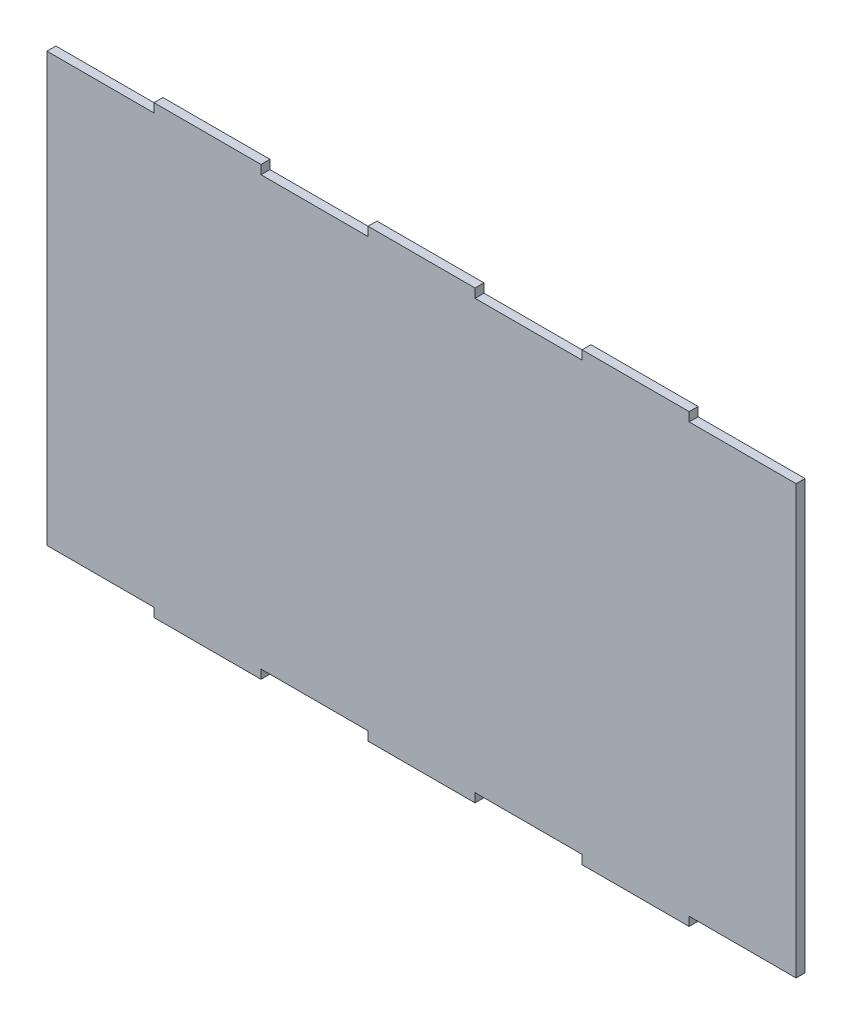
ISO-10303-21;
HEADER;
FILE_DESCRIPTION(('STEP AP214'),'2;1');
FILE_NAME('part.step','',(''),(''),'','','');
FILE_SCHEMA(('AUTOMOTIVE_DESIGN { 1 0 10303 214 1 1 1 1 }'));
ENDSEC;
DATA;
#1=APPLICATION_CONTEXT('core data for automotive mechanical design processes');
#2=APPLICATION_PROTOCOL_DEFINITION('international standard','automotive_design',2000,#1);
#3=PRODUCT_CONTEXT('',#1,'mechanical');
#4=PRODUCT('Part','Part','',(#3));
#5=PRODUCT_RELATED_PRODUCT_CATEGORY('part','',(#4));
#6=PRODUCT_DEFINITION_FORMATION('','',#4);
#7=PRODUCT_DEFINITION_CONTEXT('part definition',#1,'design');
#8=PRODUCT_DEFINITION('design','',#6,#7);
#9=PRODUCT_DEFINITION_SHAPE('','',#8);
#10=(LENGTH_UNIT() NAMED_UNIT(*) SI_UNIT(.MILLI.,.METRE.));
#11=(NAMED_UNIT(*) PLANE_ANGLE_UNIT() SI_UNIT($,.RADIAN.));
#12=(NAMED_UNIT(*) SI_UNIT($,.STERADIAN.) SOLID_ANGLE_UNIT());
#13=UNCERTAINTY_MEASURE_WITH_UNIT(LENGTH_MEASURE(1.E-05),#10,'distance_accuracy_value','');
#14=(GEOMETRIC_REPRESENTATION_CONTEXT(3) GLOBAL_UNCERTAINTY_ASSIGNED_CONTEXT((#13)) GLOBAL_UNIT_ASSIGNED_CONTEXT((#10,
#11,#12)) REPRESENTATION_CONTEXT('',''));
#15=CARTESIAN_POINT('',(0.,0.,0.));
#16=DIRECTION('',(0.,0.,1.));
#17=DIRECTION('',(1.,0.,0.));
#18=AXIS2_PLACEMENT_3D('',#15,#16,#17);
#19=CARTESIAN_POINT('',(360.,0.,5.));
#20=DIRECTION('',(-1.,0.,0.));
#21=DIRECTION('',(0.,0.,1.));
#22=AXIS2_PLACEMENT_3D('',#19,#20,#21);
#23=PLANE('',#22);
#24=DIRECTION('',(0.,1.,0.));
#25=VECTOR('',#24,1.);
#26=CARTESIAN_POINT('',(360.,0.,0.));
#27=LINE('',#26,#25);
#28=CARTESIAN_POINT('',(360.,0.,0.));
#29=VERTEX_POINT('',#28);
#30=CARTESIAN_POINT('',(360.,5.,0.));
#31=VERTEX_POINT('',#30);
#32=EDGE_CURVE('E262',#29,#31,#27,.T.);
#33=ORIENTED_EDGE('',*,*,#32,.T.);
#34=DIRECTION('',(0.,0.,-1.));
#35=VECTOR('',#34,1.);
#36=CARTESIAN_POINT('',(360.,5.,5.));
#37=LINE('',#36,#35);
#38=CARTESIAN_POINT('',(360.,5.,5.));
#39=VERTEX_POINT('',#38);
#40=EDGE_CURVE('E11',#39,#31,#37,.T.);
#41=ORIENTED_EDGE('',*,*,#40,.F.);
#42=DIRECTION('',(0.,1.,0.));
#43=VECTOR('',#42,1.);
#44=CARTESIAN_POINT('',(360.,0.,5.));
#45=LINE('',#44,#43);
#46=CARTESIAN_POINT('',(360.,0.,5.));
#47=VERTEX_POINT('',#46);
#48=EDGE_CURVE('E359',#47,#39,#45,.T.);
#49=ORIENTED_EDGE('',*,*,#48,.F.);
#50=DIRECTION('',(0.,0.,-1.));
#51=VECTOR('',#50,1.);
#52=CARTESIAN_POINT('',(360.,0.,5.));
#53=LINE('',#52,#51);
#54=EDGE_CURVE('E258',#47,#29,#53,.T.);
#55=ORIENTED_EDGE('',*,*,#54,.T.);
#56=EDGE_LOOP('',(#33,#41,#49,#55));
#57=FACE_BOUND('',#56,.T.);
#58=ADVANCED_FACE('F41',(#57),#23,.F.);
#59=CARTESIAN_POINT('',(0.,5.,5.));
#60=DIRECTION('',(0.,1.,0.));
#61=DIRECTION('',(0.,0.,1.));
#62=AXIS2_PLACEMENT_3D('',#59,#60,#61);
#63=PLANE('',#62);
#64=DIRECTION('',(1.,0.,0.));
#65=VECTOR('',#64,1.);
#66=CARTESIAN_POINT('',(0.,5.,0.));
#67=LINE('',#66,#65);
#68=CARTESIAN_POINT('',(420.,5.,0.));
#69=VERTEX_POINT('',#68);
#70=EDGE_CURVE('E266',#31,#69,#67,.T.);
#71=ORIENTED_EDGE('',*,*,#70,.T.);
#72=DIRECTION('',(0.,0.,-1.));
#73=VECTOR('',#72,1.);
#74=CARTESIAN_POINT('',(420.,5.,5.));
#75=LINE('',#74,#73);
#76=CARTESIAN_POINT('',(420.,5.,5.));
#77=VERTEX_POINT('',#76);
#78=EDGE_CURVE('E50',#77,#69,#75,.T.);
#79=ORIENTED_EDGE('',*,*,#78,.F.);
#80=DIRECTION('',(1.,0.,0.));
#81=VECTOR('',#80,1.);
#82=CARTESIAN_POINT('',(0.,5.,5.));
#83=LINE('',#82,#81);
#84=EDGE_CURVE('E161',#39,#77,#83,.T.);
#85=ORIENTED_EDGE('',*,*,#84,.F.);
#86=ORIENTED_EDGE('',*,*,#40,.T.);
#87=EDGE_LOOP('',(#71,#79,#85,#86));
#88=FACE_BOUND('',#87,.T.);
#89=ADVANCED_FACE('F560',(#88),#63,.F.);
#90=CARTESIAN_POINT('',(420.,0.,5.));
#91=DIRECTION('',(-1.,0.,0.));
#92=DIRECTION('',(0.,0.,1.));
#93=AXIS2_PLACEMENT_3D('',#90,#91,#92);
#94=PLANE('',#93);
#95=DIRECTION('',(0.,1.,0.));
#96=VECTOR('',#95,1.);
#97=CARTESIAN_POINT('',(420.,0.,0.));
#98=LINE('',#97,#96);
#99=CARTESIAN_POINT('',(420.,245.,0.));
#100=VERTEX_POINT('',#99);
#101=EDGE_CURVE('E269',#69,#100,#98,.T.);
#102=ORIENTED_EDGE('',*,*,#101,.T.);
#103=DIRECTION('',(0.,0.,-1.));
#104=VECTOR('',#103,1.);
#105=CARTESIAN_POINT('',(420.,245.,5.));
#106=LINE('',#105,#104);
#107=CARTESIAN_POINT('',(420.,245.,5.));
#108=VERTEX_POINT('',#107);
#109=EDGE_CURVE('E436',#108,#100,#106,.T.);
#110=ORIENTED_EDGE('',*,*,#109,.F.);
#111=DIRECTION('',(0.,1.,0.));
#112=VECTOR('',#111,1.);
#113=CARTESIAN_POINT('',(420.,0.,5.));
#114=LINE('',#113,#112);
#115=EDGE_CURVE('E445',#77,#108,#114,.T.);
#116=ORIENTED_EDGE('',*,*,#115,.F.);
#117=ORIENTED_EDGE('',*,*,#78,.T.);
#118=EDGE_LOOP('',(#102,#110,#116,#117));
#119=FACE_BOUND('',#118,.T.);
#120=ADVANCED_FACE('F443',(#119),#94,.F.);
#121=CARTESIAN_POINT('',(0.,245.,5.));
#122=DIRECTION('',(0.,1.,0.));
#123=DIRECTION('',(0.,0.,1.));
#124=AXIS2_PLACEMENT_3D('',#121,#122,#123);
#125=PLANE('',#124);
#126=DIRECTION('',(1.,0.,0.));
#127=VECTOR('',#126,1.);
#128=CARTESIAN_POINT('',(0.,245.,0.));
#129=LINE('',#128,#127);
#130=CARTESIAN_POINT('',(360.,245.,0.));
#131=VERTEX_POINT('',#130);
#132=EDGE_CURVE('E273',#131,#100,#129,.T.);
#133=ORIENTED_EDGE('',*,*,#132,.F.);
#134=DIRECTION('',(0.,0.,-1.));
#135=VECTOR('',#134,1.);
#136=CARTESIAN_POINT('',(360.,245.,5.));
#137=LINE('',#136,#135);
#138=CARTESIAN_POINT('',(360.,245.,5.));
#139=VERTEX_POINT('',#138);
#140=EDGE_CURVE('E433',#139,#131,#137,.T.);
#141=ORIENTED_EDGE('',*,*,#140,.F.);
#142=DIRECTION('',(1.,0.,0.));
#143=VECTOR('',#142,1.);
#144=CARTESIAN_POINT('',(0.,245.,5.));
#145=LINE('',#144,#143);
#146=EDGE_CURVE('E455',#139,#108,#145,.T.);
#147=ORIENTED_EDGE('',*,*,#146,.T.);
#148=ORIENTED_EDGE('',*,*,#109,.T.);
#149=EDGE_LOOP('',(#133,#141,#147,#148));
#150=FACE_BOUND('',#149,.T.);
#151=ADVANCED_FACE('F452',(#150),#125,.T.);
#152=CARTESIAN_POINT('',(360.,0.,5.));
#153=DIRECTION('',(1.,0.,0.));
#154=DIRECTION('',(0.,0.,-1.));
#155=AXIS2_PLACEMENT_3D('',#152,#153,#154);
#156=PLANE('',#155);
#157=DIRECTION('',(0.,-1.,0.));
#158=VECTOR('',#157,1.);
#159=CARTESIAN_POINT('',(360.,0.,0.));
#160=LINE('',#159,#158);
#161=CARTESIAN_POINT('',(360.,250.,0.));
#162=VERTEX_POINT('',#161);
#163=EDGE_CURVE('E277',#162,#131,#160,.T.);
#164=ORIENTED_EDGE('',*,*,#163,.F.);
#165=DIRECTION('',(0.,0.,-1.));
#166=VECTOR('',#165,1.);
#167=CARTESIAN_POINT('',(360.,250.,5.));
#168=LINE('',#167,#166);
#169=CARTESIAN_POINT('',(360.,250.,5.));
#170=VERTEX_POINT('',#169);
#171=EDGE_CURVE('E430',#170,#162,#168,.T.);
#172=ORIENTED_EDGE('',*,*,#171,.F.);
#173=DIRECTION('',(0.,-1.,0.));
#174=VECTOR('',#173,1.);
#175=CARTESIAN_POINT('',(360.,0.,5.));
#176=LINE('',#175,#174);
#177=EDGE_CURVE('E459',#170,#139,#176,.T.);
#178=ORIENTED_EDGE('',*,*,#177,.T.);
#179=ORIENTED_EDGE('',*,*,#140,.T.);
#180=EDGE_LOOP('',(#164,#172,#178,#179));
#181=FACE_BOUND('',#180,.T.);
#182=ADVANCED_FACE('F571',(#181),#156,.T.);
#183=CARTESIAN_POINT('',(0.,250.,5.));
#184=DIRECTION('',(0.,1.,0.));
#185=DIRECTION('',(0.,0.,1.));
#186=AXIS2_PLACEMENT_3D('',#183,#184,#185);
#187=PLANE('',#186);
#188=DIRECTION('',(1.,0.,0.));
#189=VECTOR('',#188,1.);
#190=CARTESIAN_POINT('',(0.,250.,0.));
#191=LINE('',#190,#189);
#192=CARTESIAN_POINT('',(300.,250.,0.));
#193=VERTEX_POINT('',#192);
#194=EDGE_CURVE('E281',#193,#162,#191,.T.);
#195=ORIENTED_EDGE('',*,*,#194,.F.);
#196=DIRECTION('',(0.,0.,-1.));
#197=VECTOR('',#196,1.);
#198=CARTESIAN_POINT('',(300.,250.,5.));
#199=LINE('',#198,#197);
#200=CARTESIAN_POINT('',(300.,250.,5.));
#201=VERTEX_POINT('',#200);
#202=EDGE_CURVE('E427',#201,#193,#199,.T.);
#203=ORIENTED_EDGE('',*,*,#202,.F.);
#204=DIRECTION('',(1.,0.,0.));
#205=VECTOR('',#204,1.);
#206=CARTESIAN_POINT('',(0.,250.,5.));
#207=LINE('',#206,#205);
#208=EDGE_CURVE('E463',#201,#170,#207,.T.);
#209=ORIENTED_EDGE('',*,*,#208,.T.);
#210=ORIENTED_EDGE('',*,*,#171,.T.);
#211=EDGE_LOOP('',(#195,#203,#209,#210));
#212=FACE_BOUND('',#211,.T.);
#213=ADVANCED_FACE('F574',(#212),#187,.T.);
#214=CARTESIAN_POINT('',(300.,0.,5.));
#215=DIRECTION('',(-1.,0.,0.));
#216=DIRECTION('',(0.,0.,1.));
#217=AXIS2_PLACEMENT_3D('',#214,#215,#216);
#218=PLANE('',#217);
#219=DIRECTION('',(0.,1.,0.));
#220=VECTOR('',#219,1.);
#221=CARTESIAN_POINT('',(300.,0.,0.));
#222=LINE('',#221,#220);
#223=CARTESIAN_POINT('',(300.,245.,0.));
#224=VERTEX_POINT('',#223);
#225=EDGE_CURVE('E285',#224,#193,#222,.T.);
#226=ORIENTED_EDGE('',*,*,#225,.F.);
#227=DIRECTION('',(0.,0.,-1.));
#228=VECTOR('',#227,1.);
#229=CARTESIAN_POINT('',(300.,245.,5.));
#230=LINE('',#229,#228);
#231=CARTESIAN_POINT('',(300.,245.,5.));
#232=VERTEX_POINT('',#231);
#233=EDGE_CURVE('E424',#232,#224,#230,.T.);
#234=ORIENTED_EDGE('',*,*,#233,.F.);
#235=DIRECTION('',(0.,1.,0.));
#236=VECTOR('',#235,1.);
#237=CARTESIAN_POINT('',(300.,0.,5.));
#238=LINE('',#237,#236);
#239=EDGE_CURVE('E471',#232,#201,#238,.T.);
#240=ORIENTED_EDGE('',*,*,#239,.T.);
#241=ORIENTED_EDGE('',*,*,#202,.T.);
#242=EDGE_LOOP('',(#226,#234,#240,#241));
#243=FACE_BOUND('',#242,.T.);
#244=ADVANCED_FACE('F578',(#243),#218,.T.);
#245=CARTESIAN_POINT('',(0.,245.,5.));
#246=DIRECTION('',(0.,1.,0.));
#247=DIRECTION('',(0.,0.,1.));
#248=AXIS2_PLACEMENT_3D('',#245,#246,#247);
#249=PLANE('',#248);
#250=DIRECTION('',(1.,0.,0.));
#251=VECTOR('',#250,1.);
#252=CARTESIAN_POINT('',(0.,245.,0.));
#253=LINE('',#252,#251);
#254=CARTESIAN_POINT('',(240.,245.,0.));
#255=VERTEX_POINT('',#254);
#256=EDGE_CURVE('E289',#255,#224,#253,.T.);
#257=ORIENTED_EDGE('',*,*,#256,.F.);
#258=DIRECTION('',(0.,0.,-1.));
#259=VECTOR('',#258,1.);
#260=CARTESIAN_POINT('',(240.,245.,5.));
#261=LINE('',#260,#259);
#262=CARTESIAN_POINT('',(240.,245.,5.));
#263=VERTEX_POINT('',#262);
#264=EDGE_CURVE('E421',#263,#255,#261,.T.);
#265=ORIENTED_EDGE('',*,*,#264,.F.);
#266=DIRECTION('',(1.,0.,0.));
#267=VECTOR('',#266,1.);
#268=CARTESIAN_POINT('',(0.,245.,5.));
#269=LINE('',#268,#267);
#270=EDGE_CURVE('E475',#263,#232,#269,.T.);
#271=ORIENTED_EDGE('',*,*,#270,.T.);
#272=ORIENTED_EDGE('',*,*,#233,.T.);
#273=EDGE_LOOP('',(#257,#265,#271,#272));
#274=FACE_BOUND('',#273,.T.);
#275=ADVANCED_FACE('F582',(#274),#249,.T.);
#276=CARTESIAN_POINT('',(240.,0.,5.));
#277=DIRECTION('',(1.,0.,0.));
#278=DIRECTION('',(0.,0.,-1.));
#279=AXIS2_PLACEMENT_3D('',#276,#277,#278);
#280=PLANE('',#279);
#281=DIRECTION('',(0.,-1.,0.));
#282=VECTOR('',#281,1.);
#283=CARTESIAN_POINT('',(240.,0.,0.));
#284=LINE('',#283,#282);
#285=CARTESIAN_POINT('',(240.,250.,0.));
#286=VERTEX_POINT('',#285);
#287=EDGE_CURVE('E293',#286,#255,#284,.T.);
#288=ORIENTED_EDGE('',*,*,#287,.F.);
#289=DIRECTION('',(0.,0.,-1.));
#290=VECTOR('',#289,1.);
#291=CARTESIAN_POINT('',(240.,250.,5.));
#292=LINE('',#291,#290);
#293=CARTESIAN_POINT('',(240.,250.,5.));
#294=VERTEX_POINT('',#293);
#295=EDGE_CURVE('E418',#294,#286,#292,.T.);
#296=ORIENTED_EDGE('',*,*,#295,.F.);
#297=DIRECTION('',(0.,-1.,0.));
#298=VECTOR('',#297,1.);
#299=CARTESIAN_POINT('',(240.,0.,5.));
#300=LINE('',#299,#298);
#301=EDGE_CURVE('E479',#294,#263,#300,.T.);
#302=ORIENTED_EDGE('',*,*,#301,.T.);
#303=ORIENTED_EDGE('',*,*,#264,.T.);
#304=EDGE_LOOP('',(#288,#296,#302,#303));
#305=FACE_BOUND('',#304,.T.);
#306=ADVANCED_FACE('F586',(#305),#280,.T.);
#307=CARTESIAN_POINT('',(0.,250.,5.));
#308=DIRECTION('',(0.,1.,0.));
#309=DIRECTION('',(0.,0.,1.));
#310=AXIS2_PLACEMENT_3D('',#307,#308,#309);
#311=PLANE('',#310);
#312=DIRECTION('',(1.,0.,0.));
#313=VECTOR('',#312,1.);
#314=CARTESIAN_POINT('',(0.,250.,0.));
#315=LINE('',#314,#313);
#316=CARTESIAN_POINT('',(180.,250.,0.));
#317=VERTEX_POINT('',#316);
#318=EDGE_CURVE('E297',#317,#286,#315,.T.);
#319=ORIENTED_EDGE('',*,*,#318,.F.);
#320=DIRECTION('',(0.,0.,-1.));
#321=VECTOR('',#320,1.);
#322=CARTESIAN_POINT('',(180.,250.,5.));
#323=LINE('',#322,#321);
#324=CARTESIAN_POINT('',(180.,250.,5.));
#325=VERTEX_POINT('',#324);
#326=EDGE_CURVE('E415',#325,#317,#323,.T.);
#327=ORIENTED_EDGE('',*,*,#326,.F.);
#328=DIRECTION('',(1.,0.,0.));
#329=VECTOR('',#328,1.);
#330=CARTESIAN_POINT('',(0.,250.,5.));
#331=LINE('',#330,#329);
#332=EDGE_CURVE('E483',#325,#294,#331,.T.);
#333=ORIENTED_EDGE('',*,*,#332,.T.);
#334=ORIENTED_EDGE('',*,*,#295,.T.);
#335=EDGE_LOOP('',(#319,#327,#333,#334));
#336=FACE_BOUND('',#335,.T.);
#337=ADVANCED_FACE('F590',(#336),#311,.T.);
#338=CARTESIAN_POINT('',(180.,0.,5.));
#339=DIRECTION('',(-1.,0.,0.));
#340=DIRECTION('',(0.,0.,1.));
#341=AXIS2_PLACEMENT_3D('',#338,#339,#340);
#342=PLANE('',#341);
#343=DIRECTION('',(0.,1.,0.));
#344=VECTOR('',#343,1.);
#345=CARTESIAN_POINT('',(180.,0.,0.));
#346=LINE('',#345,#344);
#347=CARTESIAN_POINT('',(180.,245.,0.));
#348=VERTEX_POINT('',#347);
#349=EDGE_CURVE('E301',#348,#317,#346,.T.);
#350=ORIENTED_EDGE('',*,*,#349,.F.);
#351=DIRECTION('',(0.,0.,-1.));
#352=VECTOR('',#351,1.);
#353=CARTESIAN_POINT('',(180.,245.,5.));
#354=LINE('',#353,#352);
#355=CARTESIAN_POINT('',(180.,245.,5.));
#356=VERTEX_POINT('',#355);
#357=EDGE_CURVE('E412',#356,#348,#354,.T.);
#358=ORIENTED_EDGE('',*,*,#357,.F.);
#359=DIRECTION('',(0.,1.,0.));
#360=VECTOR('',#359,1.);
#361=CARTESIAN_POINT('',(180.,0.,5.));
#362=LINE('',#361,#360);
#363=EDGE_CURVE('E487',#356,#325,#362,.T.);
#364=ORIENTED_EDGE('',*,*,#363,.T.);
#365=ORIENTED_EDGE('',*,*,#326,.T.);
#366=EDGE_LOOP('',(#350,#358,#364,#365));
#367=FACE_BOUND('',#366,.T.);
#368=ADVANCED_FACE('F594',(#367),#342,.T.);
#369=CARTESIAN_POINT('',(0.,245.,5.));
#370=DIRECTION('',(0.,1.,0.));
#371=DIRECTION('',(0.,0.,1.));
#372=AXIS2_PLACEMENT_3D('',#369,#370,#371);
#373=PLANE('',#372);
#374=DIRECTION('',(1.,0.,0.));
#375=VECTOR('',#374,1.);
#376=CARTESIAN_POINT('',(0.,245.,0.));
#377=LINE('',#376,#375);
#378=CARTESIAN_POINT('',(120.,245.,0.));
#379=VERTEX_POINT('',#378);
#380=EDGE_CURVE('E305',#379,#348,#377,.T.);
#381=ORIENTED_EDGE('',*,*,#380,.F.);
#382=DIRECTION('',(0.,0.,-1.));
#383=VECTOR('',#382,1.);
#384=CARTESIAN_POINT('',(120.,245.,5.));
#385=LINE('',#384,#383);
#386=CARTESIAN_POINT('',(120.,245.,5.));
#387=VERTEX_POINT('',#386);
#388=EDGE_CURVE('E409',#387,#379,#385,.T.);
#389=ORIENTED_EDGE('',*,*,#388,.F.);
#390=DIRECTION('',(1.,0.,0.));
#391=VECTOR('',#390,1.);
#392=CARTESIAN_POINT('',(0.,245.,5.));
#393=LINE('',#392,#391);
#394=EDGE_CURVE('E491',#387,#356,#393,.T.);
#395=ORIENTED_EDGE('',*,*,#394,.T.);
#396=ORIENTED_EDGE('',*,*,#357,.T.);
#397=EDGE_LOOP('',(#381,#389,#395,#396));
#398=FACE_BOUND('',#397,.T.);
#399=ADVANCED_FACE('F598',(#398),#373,.T.);
#400=CARTESIAN_POINT('',(120.,0.,5.));
#401=DIRECTION('',(1.,0.,0.));
#402=DIRECTION('',(0.,0.,-1.));
#403=AXIS2_PLACEMENT_3D('',#400,#401,#402);
#404=PLANE('',#403);
#405=DIRECTION('',(0.,-1.,0.));
#406=VECTOR('',#405,1.);
#407=CARTESIAN_POINT('',(120.,0.,0.));
#408=LINE('',#407,#406);
#409=CARTESIAN_POINT('',(120.,250.,0.));
#410=VERTEX_POINT('',#409);
#411=EDGE_CURVE('E309',#410,#379,#408,.T.);
#412=ORIENTED_EDGE('',*,*,#411,.F.);
#413=DIRECTION('',(0.,0.,-1.));
#414=VECTOR('',#413,1.);
#415=CARTESIAN_POINT('',(120.,250.,5.));
#416=LINE('',#415,#414);
#417=CARTESIAN_POINT('',(120.,250.,5.));
#418=VERTEX_POINT('',#417);
#419=EDGE_CURVE('E406',#418,#410,#416,.T.);
#420=ORIENTED_EDGE('',*,*,#419,.F.);
#421=DIRECTION('',(0.,-1.,0.));
#422=VECTOR('',#421,1.);
#423=CARTESIAN_POINT('',(120.,0.,5.));
#424=LINE('',#423,#422);
#425=EDGE_CURVE('E495',#418,#387,#424,.T.);
#426=ORIENTED_EDGE('',*,*,#425,.T.);
#427=ORIENTED_EDGE('',*,*,#388,.T.);
#428=EDGE_LOOP('',(#412,#420,#426,#427));
#429=FACE_BOUND('',#428,.T.);
#430=ADVANCED_FACE('F602',(#429),#404,.T.);
#431=CARTESIAN_POINT('',(0.,250.,5.));
#432=DIRECTION('',(0.,1.,0.));
#433=DIRECTION('',(0.,0.,1.));
#434=AXIS2_PLACEMENT_3D('',#431,#432,#433);
#435=PLANE('',#434);
#436=DIRECTION('',(1.,0.,0.));
#437=VECTOR('',#436,1.);
#438=CARTESIAN_POINT('',(0.,250.,0.));
#439=LINE('',#438,#437);
#440=CARTESIAN_POINT('',(60.,250.,0.));
#441=VERTEX_POINT('',#440);
#442=EDGE_CURVE('E313',#441,#410,#439,.T.);
#443=ORIENTED_EDGE('',*,*,#442,.F.);
#444=DIRECTION('',(0.,0.,-1.));
#445=VECTOR('',#444,1.);
#446=CARTESIAN_POINT('',(60.,250.,5.));
#447=LINE('',#446,#445);
#448=CARTESIAN_POINT('',(60.,250.,5.));
#449=VERTEX_POINT('',#448);
#450=EDGE_CURVE('E403',#449,#441,#447,.T.);
#451=ORIENTED_EDGE('',*,*,#450,.F.);
#452=DIRECTION('',(1.,0.,0.));
#453=VECTOR('',#452,1.);
#454=CARTESIAN_POINT('',(0.,250.,5.));
#455=LINE('',#454,#453);
#456=EDGE_CURVE('E499',#449,#418,#455,.T.);
#457=ORIENTED_EDGE('',*,*,#456,.T.);
#458=ORIENTED_EDGE('',*,*,#419,.T.);
#459=EDGE_LOOP('',(#443,#451,#457,#458));
#460=FACE_BOUND('',#459,.T.);
#461=ADVANCED_FACE('F606',(#460),#435,.T.);
#462=CARTESIAN_POINT('',(60.,0.,5.));
#463=DIRECTION('',(-1.,0.,0.));
#464=DIRECTION('',(0.,0.,1.));
#465=AXIS2_PLACEMENT_3D('',#462,#463,#464);
#466=PLANE('',#465);
#467=DIRECTION('',(0.,1.,0.));
#468=VECTOR('',#467,1.);
#469=CARTESIAN_POINT('',(60.,0.,0.));
#470=LINE('',#469,#468);
#471=CARTESIAN_POINT('',(60.,245.,0.));
#472=VERTEX_POINT('',#471);
#473=EDGE_CURVE('E317',#472,#441,#470,.T.);
#474=ORIENTED_EDGE('',*,*,#473,.F.);
#475=DIRECTION('',(0.,0.,-1.));
#476=VECTOR('',#475,1.);
#477=CARTESIAN_POINT('',(60.,245.,5.));
#478=LINE('',#477,#476);
#479=CARTESIAN_POINT('',(60.,245.,5.));
#480=VERTEX_POINT('',#479);
#481=EDGE_CURVE('E400',#480,#472,#478,.T.);
#482=ORIENTED_EDGE('',*,*,#481,.F.);
#483=DIRECTION('',(0.,1.,0.));
#484=VECTOR('',#483,1.);
#485=CARTESIAN_POINT('',(60.,0.,5.));
#486=LINE('',#485,#484);
#487=EDGE_CURVE('E503',#480,#449,#486,.T.);
#488=ORIENTED_EDGE('',*,*,#487,.T.);
#489=ORIENTED_EDGE('',*,*,#450,.T.);
#490=EDGE_LOOP('',(#474,#482,#488,#489));
#491=FACE_BOUND('',#490,.T.);
#492=ADVANCED_FACE('F610',(#491),#466,.T.);
#493=CARTESIAN_POINT('',(0.,245.,5.));
#494=DIRECTION('',(0.,1.,0.));
#495=DIRECTION('',(0.,0.,1.));
#496=AXIS2_PLACEMENT_3D('',#493,#494,#495);
#497=PLANE('',#496);
#498=DIRECTION('',(1.,0.,0.));
#499=VECTOR('',#498,1.);
#500=CARTESIAN_POINT('',(0.,245.,0.));
#501=LINE('',#500,#499);
#502=CARTESIAN_POINT('',(0.,245.,0.));
#503=VERTEX_POINT('',#502);
#504=EDGE_CURVE('E321',#503,#472,#501,.T.);
#505=ORIENTED_EDGE('',*,*,#504,.F.);
#506=DIRECTION('',(0.,0.,-1.));
#507=VECTOR('',#506,1.);
#508=CARTESIAN_POINT('',(0.,245.,5.));
#509=LINE('',#508,#507);
#510=CARTESIAN_POINT('',(0.,245.,5.));
#511=VERTEX_POINT('',#510);
#512=EDGE_CURVE('E397',#511,#503,#509,.T.);
#513=ORIENTED_EDGE('',*,*,#512,.F.);
#514=DIRECTION('',(1.,0.,0.));
#515=VECTOR('',#514,1.);
#516=CARTESIAN_POINT('',(0.,245.,5.));
#517=LINE('',#516,#515);
#518=EDGE_CURVE('E507',#511,#480,#517,.T.);
#519=ORIENTED_EDGE('',*,*,#518,.T.);
#520=ORIENTED_EDGE('',*,*,#481,.T.);
#521=EDGE_LOOP('',(#505,#513,#519,#520));
#522=FACE_BOUND('',#521,.T.);
#523=ADVANCED_FACE('F614',(#522),#497,.T.);
#524=CARTESIAN_POINT('',(0.,0.,5.));
#525=DIRECTION('',(-1.,0.,0.));
#526=DIRECTION('',(0.,0.,1.));
#527=AXIS2_PLACEMENT_3D('',#524,#525,#526);
#528=PLANE('',#527);
#529=DIRECTION('',(0.,1.,0.));
#530=VECTOR('',#529,1.);
#531=CARTESIAN_POINT('',(0.,0.,0.));
#532=LINE('',#531,#530);
#533=CARTESIAN_POINT('',(0.,5.,0.));
#534=VERTEX_POINT('',#533);
#535=EDGE_CURVE('E325',#534,#503,#532,.T.);
#536=ORIENTED_EDGE('',*,*,#535,.F.);
#537=DIRECTION('',(0.,0.,-1.));
#538=VECTOR('',#537,1.);
#539=CARTESIAN_POINT('',(0.,5.,5.));
#540=LINE('',#539,#538);
#541=CARTESIAN_POINT('',(0.,5.,5.));
#542=VERTEX_POINT('',#541);
#543=EDGE_CURVE('E394',#542,#534,#540,.T.);
#544=ORIENTED_EDGE('',*,*,#543,.F.);
#545=DIRECTION('',(0.,1.,0.));
#546=VECTOR('',#545,1.);
#547=CARTESIAN_POINT('',(0.,0.,5.));
#548=LINE('',#547,#546);
#549=EDGE_CURVE('E511',#542,#511,#548,.T.);
#550=ORIENTED_EDGE('',*,*,#549,.T.);
#551=ORIENTED_EDGE('',*,*,#512,.T.);
#552=EDGE_LOOP('',(#536,#544,#550,#551));
#553=FACE_BOUND('',#552,.T.);
#554=ADVANCED_FACE('F618',(#553),#528,.T.);
#555=CARTESIAN_POINT('',(0.,5.,5.));
#556=DIRECTION('',(0.,1.,0.));
#557=DIRECTION('',(0.,0.,1.));
#558=AXIS2_PLACEMENT_3D('',#555,#556,#557);
#559=PLANE('',#558);
#560=DIRECTION('',(1.,0.,0.));
#561=VECTOR('',#560,1.);
#562=CARTESIAN_POINT('',(0.,5.,0.));
#563=LINE('',#562,#561);
#564=CARTESIAN_POINT('',(60.,5.,0.));
#565=VERTEX_POINT('',#564);
#566=EDGE_CURVE('E329',#534,#565,#563,.T.);
#567=ORIENTED_EDGE('',*,*,#566,.T.);
#568=DIRECTION('',(0.,0.,-1.));
#569=VECTOR('',#568,1.);
#570=CARTESIAN_POINT('',(60.,5.,5.));
#571=LINE('',#570,#569);
#572=CARTESIAN_POINT('',(60.,5.,5.));
#573=VERTEX_POINT('',#572);
#574=EDGE_CURVE('E390',#573,#565,#571,.T.);
#575=ORIENTED_EDGE('',*,*,#574,.F.);
#576=DIRECTION('',(1.,0.,0.));
#577=VECTOR('',#576,1.);
#578=CARTESIAN_POINT('',(0.,5.,5.));
#579=LINE('',#578,#577);
#580=EDGE_CURVE('E515',#542,#573,#579,.T.);
#581=ORIENTED_EDGE('',*,*,#580,.F.);
#582=ORIENTED_EDGE('',*,*,#543,.T.);
#583=EDGE_LOOP('',(#567,#575,#581,#582));
#584=FACE_BOUND('',#583,.T.);
#585=ADVANCED_FACE('F622',(#584),#559,.F.);
#586=CARTESIAN_POINT('',(60.,0.,5.));
#587=DIRECTION('',(1.,0.,0.));
#588=DIRECTION('',(0.,0.,-1.));
#589=AXIS2_PLACEMENT_3D('',#586,#587,#588);
#590=PLANE('',#589);
#591=DIRECTION('',(0.,-1.,0.));
#592=VECTOR('',#591,1.);
#593=CARTESIAN_POINT('',(60.,0.,0.));
#594=LINE('',#593,#592);
#595=CARTESIAN_POINT('',(60.,0.,0.));
#596=VERTEX_POINT('',#595);
#597=EDGE_CURVE('E332',#565,#596,#594,.T.);
#598=ORIENTED_EDGE('',*,*,#597,.T.);
#599=DIRECTION('',(0.,0.,-1.));
#600=VECTOR('',#599,1.);
#601=CARTESIAN_POINT('',(60.,0.,5.));
#602=LINE('',#601,#600);
#603=CARTESIAN_POINT('',(60.,0.,5.));
#604=VERTEX_POINT('',#603);
#605=EDGE_CURVE('E386',#604,#596,#602,.T.);
#606=ORIENTED_EDGE('',*,*,#605,.F.);
#607=DIRECTION('',(0.,-1.,0.));
#608=VECTOR('',#607,1.);
#609=CARTESIAN_POINT('',(60.,0.,5.));
#610=LINE('',#609,#608);
#611=EDGE_CURVE('E518',#573,#604,#610,.T.);
#612=ORIENTED_EDGE('',*,*,#611,.F.);
#613=ORIENTED_EDGE('',*,*,#574,.T.);
#614=EDGE_LOOP('',(#598,#606,#612,#613));
#615=FACE_BOUND('',#614,.T.);
#616=ADVANCED_FACE('F626',(#615),#590,.F.);
#617=CARTESIAN_POINT('',(0.,0.,5.));
#618=DIRECTION('',(0.,1.,0.));
#619=DIRECTION('',(0.,0.,1.));
#620=AXIS2_PLACEMENT_3D('',#617,#618,#619);
#621=PLANE('',#620);
#622=DIRECTION('',(1.,0.,0.));
#623=VECTOR('',#622,1.);
#624=CARTESIAN_POINT('',(0.,0.,0.));
#625=LINE('',#624,#623);
#626=CARTESIAN_POINT('',(120.,0.,0.));
#627=VERTEX_POINT('',#626);
#628=EDGE_CURVE('E335',#596,#627,#625,.T.);
#629=ORIENTED_EDGE('',*,*,#628,.T.);
#630=DIRECTION('',(0.,0.,-1.));
#631=VECTOR('',#630,1.);
#632=CARTESIAN_POINT('',(120.,0.,5.));
#633=LINE('',#632,#631);
#634=CARTESIAN_POINT('',(120.,0.,5.));
#635=VERTEX_POINT('',#634);
#636=EDGE_CURVE('E382',#635,#627,#633,.T.);
#637=ORIENTED_EDGE('',*,*,#636,.F.);
#638=DIRECTION('',(1.,0.,0.));
#639=VECTOR('',#638,1.);
#640=CARTESIAN_POINT('',(0.,0.,5.));
#641=LINE('',#640,#639);
#642=EDGE_CURVE('E521',#604,#635,#641,.T.);
#643=ORIENTED_EDGE('',*,*,#642,.F.);
#644=ORIENTED_EDGE('',*,*,#605,.T.);
#645=EDGE_LOOP('',(#629,#637,#643,#644));
#646=FACE_BOUND('',#645,.T.);
#647=ADVANCED_FACE('F630',(#646),#621,.F.);
#648=CARTESIAN_POINT('',(120.,0.,5.));
#649=DIRECTION('',(-1.,0.,0.));
#650=DIRECTION('',(0.,0.,1.));
#651=AXIS2_PLACEMENT_3D('',#648,#649,#650);
#652=PLANE('',#651);
#653=DIRECTION('',(0.,1.,0.));
#654=VECTOR('',#653,1.);
#655=CARTESIAN_POINT('',(120.,0.,0.));
#656=LINE('',#655,#654);
#657=CARTESIAN_POINT('',(120.,5.,0.));
#658=VERTEX_POINT('',#657);
#659=EDGE_CURVE('E338',#627,#658,#656,.T.);
#660=ORIENTED_EDGE('',*,*,#659,.T.);
#661=DIRECTION('',(0.,0.,-1.));
#662=VECTOR('',#661,1.);
#663=CARTESIAN_POINT('',(120.,5.,5.));
#664=LINE('',#663,#662);
#665=CARTESIAN_POINT('',(120.,5.,5.));
#666=VERTEX_POINT('',#665);
#667=EDGE_CURVE('E378',#666,#658,#664,.T.);
#668=ORIENTED_EDGE('',*,*,#667,.F.);
#669=DIRECTION('',(0.,1.,0.));
#670=VECTOR('',#669,1.);
#671=CARTESIAN_POINT('',(120.,0.,5.));
#672=LINE('',#671,#670);
#673=EDGE_CURVE('E524',#635,#666,#672,.T.);
#674=ORIENTED_EDGE('',*,*,#673,.F.);
#675=ORIENTED_EDGE('',*,*,#636,.T.);
#676=EDGE_LOOP('',(#660,#668,#674,#675));
#677=FACE_BOUND('',#676,.T.);
#678=ADVANCED_FACE('F634',(#677),#652,.F.);
#679=CARTESIAN_POINT('',(0.,5.,5.));
#680=DIRECTION('',(0.,1.,0.));
#681=DIRECTION('',(0.,0.,1.));
#682=AXIS2_PLACEMENT_3D('',#679,#680,#681);
#683=PLANE('',#682);
#684=DIRECTION('',(1.,0.,0.));
#685=VECTOR('',#684,1.);
#686=CARTESIAN_POINT('',(0.,5.,0.));
#687=LINE('',#686,#685);
#688=CARTESIAN_POINT('',(180.,5.,0.));
#689=VERTEX_POINT('',#688);
#690=EDGE_CURVE('E341',#658,#689,#687,.T.);
#691=ORIENTED_EDGE('',*,*,#690,.T.);
#692=DIRECTION('',(0.,0.,-1.));
#693=VECTOR('',#692,1.);
#694=CARTESIAN_POINT('',(180.,5.,5.));
#695=LINE('',#694,#693);
#696=CARTESIAN_POINT('',(180.,5.,5.));
#697=VERTEX_POINT('',#696);
#698=EDGE_CURVE('E374',#697,#689,#695,.T.);
#699=ORIENTED_EDGE('',*,*,#698,.F.);
#700=DIRECTION('',(1.,0.,0.));
#701=VECTOR('',#700,1.);
#702=CARTESIAN_POINT('',(0.,5.,5.));
#703=LINE('',#702,#701);
#704=EDGE_CURVE('E527',#666,#697,#703,.T.);
#705=ORIENTED_EDGE('',*,*,#704,.F.);
#706=ORIENTED_EDGE('',*,*,#667,.T.);
#707=EDGE_LOOP('',(#691,#699,#705,#706));
#708=FACE_BOUND('',#707,.T.);
#709=ADVANCED_FACE('F638',(#708),#683,.F.);
#710=CARTESIAN_POINT('',(180.,0.,5.));
#711=DIRECTION('',(1.,0.,0.));
#712=DIRECTION('',(0.,0.,-1.));
#713=AXIS2_PLACEMENT_3D('',#710,#711,#712);
#714=PLANE('',#713);
#715=DIRECTION('',(0.,-1.,0.));
#716=VECTOR('',#715,1.);
#717=CARTESIAN_POINT('',(180.,0.,0.));
#718=LINE('',#717,#716);
#719=CARTESIAN_POINT('',(180.,0.,0.));
#720=VERTEX_POINT('',#719);
#721=EDGE_CURVE('E344',#689,#720,#718,.T.);
#722=ORIENTED_EDGE('',*,*,#721,.T.);
#723=DIRECTION('',(0.,0.,-1.));
#724=VECTOR('',#723,1.);
#725=CARTESIAN_POINT('',(180.,0.,5.));
#726=LINE('',#725,#724);
#727=CARTESIAN_POINT('',(180.,0.,5.));
#728=VERTEX_POINT('',#727);
#729=EDGE_CURVE('E370',#728,#720,#726,.T.);
#730=ORIENTED_EDGE('',*,*,#729,.F.);
#731=DIRECTION('',(0.,-1.,0.));
#732=VECTOR('',#731,1.);
#733=CARTESIAN_POINT('',(180.,0.,5.));
#734=LINE('',#733,#732);
#735=EDGE_CURVE('E530',#697,#728,#734,.T.);
#736=ORIENTED_EDGE('',*,*,#735,.F.);
#737=ORIENTED_EDGE('',*,*,#698,.T.);
#738=EDGE_LOOP('',(#722,#730,#736,#737));
#739=FACE_BOUND('',#738,.T.);
#740=ADVANCED_FACE('F642',(#739),#714,.F.);
#741=CARTESIAN_POINT('',(0.,0.,5.));
#742=DIRECTION('',(0.,1.,0.));
#743=DIRECTION('',(0.,0.,1.));
#744=AXIS2_PLACEMENT_3D('',#741,#742,#743);
#745=PLANE('',#744);
#746=DIRECTION('',(1.,0.,0.));
#747=VECTOR('',#746,1.);
#748=CARTESIAN_POINT('',(0.,0.,0.));
#749=LINE('',#748,#747);
#750=CARTESIAN_POINT('',(240.,0.,0.));
#751=VERTEX_POINT('',#750);
#752=EDGE_CURVE('E347',#720,#751,#749,.T.);
#753=ORIENTED_EDGE('',*,*,#752,.T.);
#754=DIRECTION('',(0.,0.,-1.));
#755=VECTOR('',#754,1.);
#756=CARTESIAN_POINT('',(240.,0.,5.));
#757=LINE('',#756,#755);
#758=CARTESIAN_POINT('',(240.,0.,5.));
#759=VERTEX_POINT('',#758);
#760=EDGE_CURVE('E366',#759,#751,#757,.T.);
#761=ORIENTED_EDGE('',*,*,#760,.F.);
#762=DIRECTION('',(1.,0.,0.));
#763=VECTOR('',#762,1.);
#764=CARTESIAN_POINT('',(0.,0.,5.));
#765=LINE('',#764,#763);
#766=EDGE_CURVE('E533',#728,#759,#765,.T.);
#767=ORIENTED_EDGE('',*,*,#766,.F.);
#768=ORIENTED_EDGE('',*,*,#729,.T.);
#769=EDGE_LOOP('',(#753,#761,#767,#768));
#770=FACE_BOUND('',#769,.T.);
#771=ADVANCED_FACE('F541',(#770),#745,.F.);
#772=CARTESIAN_POINT('',(240.,0.,5.));
#773=DIRECTION('',(-1.,0.,0.));
#774=DIRECTION('',(0.,0.,1.));
#775=AXIS2_PLACEMENT_3D('',#772,#773,#774);
#776=PLANE('',#775);
#777=DIRECTION('',(0.,1.,0.));
#778=VECTOR('',#777,1.);
#779=CARTESIAN_POINT('',(240.,0.,0.));
#780=LINE('',#779,#778);
#781=CARTESIAN_POINT('',(240.,5.,0.));
#782=VERTEX_POINT('',#781);
#783=EDGE_CURVE('E350',#751,#782,#780,.T.);
#784=ORIENTED_EDGE('',*,*,#783,.T.);
#785=DIRECTION('',(0.,0.,-1.));
#786=VECTOR('',#785,1.);
#787=CARTESIAN_POINT('',(240.,5.,5.));
#788=LINE('',#787,#786);
#789=CARTESIAN_POINT('',(240.,5.,5.));
#790=VERTEX_POINT('',#789);
#791=EDGE_CURVE('E251',#790,#782,#788,.T.);
#792=ORIENTED_EDGE('',*,*,#791,.F.);
#793=DIRECTION('',(0.,1.,0.));
#794=VECTOR('',#793,1.);
#795=CARTESIAN_POINT('',(240.,0.,5.));
#796=LINE('',#795,#794);
#797=EDGE_CURVE('E240',#759,#790,#796,.T.);
#798=ORIENTED_EDGE('',*,*,#797,.F.);
#799=ORIENTED_EDGE('',*,*,#760,.T.);
#800=EDGE_LOOP('',(#784,#792,#798,#799));
#801=FACE_BOUND('',#800,.T.);
#802=ADVANCED_FACE('F545',(#801),#776,.F.);
#803=CARTESIAN_POINT('',(0.,5.,5.));
#804=DIRECTION('',(0.,1.,0.));
#805=DIRECTION('',(0.,0.,1.));
#806=AXIS2_PLACEMENT_3D('',#803,#804,#805);
#807=PLANE('',#806);
#808=DIRECTION('',(1.,0.,0.));
#809=VECTOR('',#808,1.);
#810=CARTESIAN_POINT('',(0.,5.,0.));
#811=LINE('',#810,#809);
#812=CARTESIAN_POINT('',(300.,5.,0.));
#813=VERTEX_POINT('',#812);
#814=EDGE_CURVE('E249',#782,#813,#811,.T.);
#815=ORIENTED_EDGE('',*,*,#814,.T.);
#816=DIRECTION('',(0.,0.,-1.));
#817=VECTOR('',#816,1.);
#818=CARTESIAN_POINT('',(300.,5.,5.));
#819=LINE('',#818,#817);
#820=CARTESIAN_POINT('',(300.,5.,5.));
#821=VERTEX_POINT('',#820);
#822=EDGE_CURVE('E246',#821,#813,#819,.T.);
#823=ORIENTED_EDGE('',*,*,#822,.F.);
#824=DIRECTION('',(1.,0.,0.));
#825=VECTOR('',#824,1.);
#826=CARTESIAN_POINT('',(0.,5.,5.));
#827=LINE('',#826,#825);
#828=EDGE_CURVE('E234',#790,#821,#827,.T.);
#829=ORIENTED_EDGE('',*,*,#828,.F.);
#830=ORIENTED_EDGE('',*,*,#791,.T.);
#831=EDGE_LOOP('',(#815,#823,#829,#830));
#832=FACE_BOUND('',#831,.T.);
#833=ADVANCED_FACE('F247',(#832),#807,.F.);
#834=CARTESIAN_POINT('',(300.,0.,5.));
#835=DIRECTION('',(1.,0.,0.));
#836=DIRECTION('',(0.,0.,-1.));
#837=AXIS2_PLACEMENT_3D('',#834,#835,#836);
#838=PLANE('',#837);
#839=DIRECTION('',(0.,-1.,0.));
#840=VECTOR('',#839,1.);
#841=CARTESIAN_POINT('',(300.,0.,0.));
#842=LINE('',#841,#840);
#843=CARTESIAN_POINT('',(300.,0.,0.));
#844=VERTEX_POINT('',#843);
#845=EDGE_CURVE('E147',#813,#844,#842,.T.);
#846=ORIENTED_EDGE('',*,*,#845,.T.);
#847=DIRECTION('',(0.,0.,-1.));
#848=VECTOR('',#847,1.);
#849=CARTESIAN_POINT('',(300.,0.,5.));
#850=LINE('',#849,#848);
#851=CARTESIAN_POINT('',(300.,0.,5.));
#852=VERTEX_POINT('',#851);
#853=EDGE_CURVE('E252',#852,#844,#850,.T.);
#854=ORIENTED_EDGE('',*,*,#853,.F.);
#855=DIRECTION('',(0.,-1.,0.));
#856=VECTOR('',#855,1.);
#857=CARTESIAN_POINT('',(300.,0.,5.));
#858=LINE('',#857,#856);
#859=EDGE_CURVE('E238',#821,#852,#858,.T.);
#860=ORIENTED_EDGE('',*,*,#859,.F.);
#861=ORIENTED_EDGE('',*,*,#822,.T.);
#862=EDGE_LOOP('',(#846,#854,#860,#861));
#863=FACE_BOUND('',#862,.T.);
#864=ADVANCED_FACE('F254',(#863),#838,.F.);
#865=CARTESIAN_POINT('',(0.,0.,5.));
#866=DIRECTION('',(0.,1.,0.));
#867=DIRECTION('',(0.,0.,1.));
#868=AXIS2_PLACEMENT_3D('',#865,#866,#867);
#869=PLANE('',#868);
#870=DIRECTION('',(1.,0.,0.));
#871=VECTOR('',#870,1.);
#872=CARTESIAN_POINT('',(0.,0.,0.));
#873=LINE('',#872,#871);
#874=EDGE_CURVE('E153',#844,#29,#873,.T.);
#875=ORIENTED_EDGE('',*,*,#874,.T.);
#876=ORIENTED_EDGE('',*,*,#54,.F.);
#877=DIRECTION('',(1.,0.,0.));
#878=VECTOR('',#877,1.);
#879=CARTESIAN_POINT('',(0.,0.,5.));
#880=LINE('',#879,#878);
#881=EDGE_CURVE('E58',#852,#47,#880,.T.);
#882=ORIENTED_EDGE('',*,*,#881,.F.);
#883=ORIENTED_EDGE('',*,*,#853,.T.);
#884=EDGE_LOOP('',(#875,#876,#882,#883));
#885=FACE_BOUND('',#884,.T.);
#886=ADVANCED_FACE('F549',(#885),#869,.F.);
#887=CARTESIAN_POINT('',(0.,0.,5.));
#888=DIRECTION('',(0.,0.,1.));
#889=DIRECTION('',(1.,0.,0.));
#890=AXIS2_PLACEMENT_3D('',#887,#888,#889);
#891=PLANE('',#890);
#892=ORIENTED_EDGE('',*,*,#48,.T.);
#893=ORIENTED_EDGE('',*,*,#84,.T.);
#894=ORIENTED_EDGE('',*,*,#115,.T.);
#895=ORIENTED_EDGE('',*,*,#146,.F.);
#896=ORIENTED_EDGE('',*,*,#177,.F.);
#897=ORIENTED_EDGE('',*,*,#208,.F.);
#898=ORIENTED_EDGE('',*,*,#239,.F.);
#899=ORIENTED_EDGE('',*,*,#270,.F.);
#900=ORIENTED_EDGE('',*,*,#301,.F.);
#901=ORIENTED_EDGE('',*,*,#332,.F.);
#902=ORIENTED_EDGE('',*,*,#363,.F.);
#903=ORIENTED_EDGE('',*,*,#394,.F.);
#904=ORIENTED_EDGE('',*,*,#425,.F.);
#905=ORIENTED_EDGE('',*,*,#456,.F.);
#906=ORIENTED_EDGE('',*,*,#487,.F.);
#907=ORIENTED_EDGE('',*,*,#518,.F.);
#908=ORIENTED_EDGE('',*,*,#549,.F.);
#909=ORIENTED_EDGE('',*,*,#580,.T.);
#910=ORIENTED_EDGE('',*,*,#611,.T.);
#911=ORIENTED_EDGE('',*,*,#642,.T.);
#912=ORIENTED_EDGE('',*,*,#673,.T.);
#913=ORIENTED_EDGE('',*,*,#704,.T.);
#914=ORIENTED_EDGE('',*,*,#735,.T.);
#915=ORIENTED_EDGE('',*,*,#766,.T.);
#916=ORIENTED_EDGE('',*,*,#797,.T.);
#917=ORIENTED_EDGE('',*,*,#828,.T.);
#918=ORIENTED_EDGE('',*,*,#859,.T.);
#919=ORIENTED_EDGE('',*,*,#881,.T.);
#920=EDGE_LOOP('',(#892,#893,#894,#895,#896,#897,#898,#899,#900,#901,#902,#903,#904,#905,#906,
#907,#908,#909,#910,#911,#912,#913,#914,#915,#916,#917,#918,#919));
#921=FACE_BOUND('',#920,.T.);
#922=ADVANCED_FACE('F236',(#921),#891,.T.);
#923=CARTESIAN_POINT('',(0.,0.,0.));
#924=DIRECTION('',(0.,0.,1.));
#925=DIRECTION('',(1.,0.,0.));
#926=AXIS2_PLACEMENT_3D('',#923,#924,#925);
#927=PLANE('',#926);
#928=ORIENTED_EDGE('',*,*,#32,.F.);
#929=ORIENTED_EDGE('',*,*,#874,.F.);
#930=ORIENTED_EDGE('',*,*,#845,.F.);
#931=ORIENTED_EDGE('',*,*,#814,.F.);
#932=ORIENTED_EDGE('',*,*,#783,.F.);
#933=ORIENTED_EDGE('',*,*,#752,.F.);
#934=ORIENTED_EDGE('',*,*,#721,.F.);
#935=ORIENTED_EDGE('',*,*,#690,.F.);
#936=ORIENTED_EDGE('',*,*,#659,.F.);
#937=ORIENTED_EDGE('',*,*,#628,.F.);
#938=ORIENTED_EDGE('',*,*,#597,.F.);
#939=ORIENTED_EDGE('',*,*,#566,.F.);
#940=ORIENTED_EDGE('',*,*,#535,.T.);
#941=ORIENTED_EDGE('',*,*,#504,.T.);
#942=ORIENTED_EDGE('',*,*,#473,.T.);
#943=ORIENTED_EDGE('',*,*,#442,.T.);
#944=ORIENTED_EDGE('',*,*,#411,.T.);
#945=ORIENTED_EDGE('',*,*,#380,.T.);
#946=ORIENTED_EDGE('',*,*,#349,.T.);
#947=ORIENTED_EDGE('',*,*,#318,.T.);
#948=ORIENTED_EDGE('',*,*,#287,.T.);
#949=ORIENTED_EDGE('',*,*,#256,.T.);
#950=ORIENTED_EDGE('',*,*,#225,.T.);
#951=ORIENTED_EDGE('',*,*,#194,.T.);
#952=ORIENTED_EDGE('',*,*,#163,.T.);
#953=ORIENTED_EDGE('',*,*,#132,.T.);
#954=ORIENTED_EDGE('',*,*,#101,.F.);
#955=ORIENTED_EDGE('',*,*,#70,.F.);
#956=EDGE_LOOP('',(#928,#929,#930,#931,#932,#933,#934,#935,#936,#937,#938,#939,#940,#941,#942,
#943,#944,#945,#946,#947,#948,#949,#950,#951,#952,#953,#954,#955));
#957=FACE_BOUND('',#956,.T.);
#958=ADVANCED_FACE('F448',(#957),#927,.F.);
#959=CLOSED_SHELL('',(#58,#89,#120,#151,#182,#213,#244,#275,#306,#337,#368,#399,#430,#461,#492,
#523,#554,#585,#616,#647,#678,#709,#740,#771,#802,#833,#864,#886,#922,#958));
#960=MANIFOLD_SOLID_BREP('B2',#959);
#961=ADVANCED_BREP_SHAPE_REPRESENTATION('',(#18,#960),#14);
#962=SHAPE_DEFINITION_REPRESENTATION(#9,#961);
ENDSEC;
END-ISO-10303-21;
